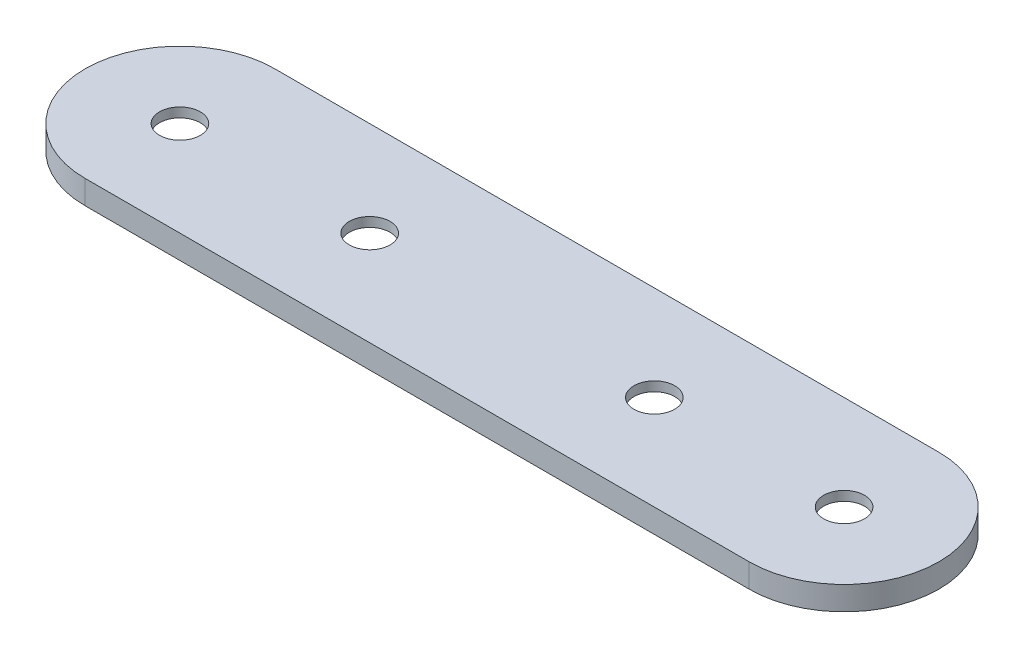
ISO-10303-21;
HEADER;
FILE_DESCRIPTION(('STEP AP214'),'2;1');
FILE_NAME('part.step','',(''),(''),'','','');
FILE_SCHEMA(('AUTOMOTIVE_DESIGN { 1 0 10303 214 1 1 1 1 }'));
ENDSEC;
DATA;
#1=APPLICATION_CONTEXT('core data for automotive mechanical design processes');
#2=APPLICATION_PROTOCOL_DEFINITION('international standard','automotive_design',2000,#1);
#3=PRODUCT_CONTEXT('',#1,'mechanical');
#4=PRODUCT('Part','Part','',(#3));
#5=PRODUCT_RELATED_PRODUCT_CATEGORY('part','',(#4));
#6=PRODUCT_DEFINITION_FORMATION('','',#4);
#7=PRODUCT_DEFINITION_CONTEXT('part definition',#1,'design');
#8=PRODUCT_DEFINITION('design','',#6,#7);
#9=PRODUCT_DEFINITION_SHAPE('','',#8);
#10=(LENGTH_UNIT() NAMED_UNIT(*) SI_UNIT(.MILLI.,.METRE.));
#11=(NAMED_UNIT(*) PLANE_ANGLE_UNIT() SI_UNIT($,.RADIAN.));
#12=(NAMED_UNIT(*) SI_UNIT($,.STERADIAN.) SOLID_ANGLE_UNIT());
#13=UNCERTAINTY_MEASURE_WITH_UNIT(LENGTH_MEASURE(1.E-05),#10,'distance_accuracy_value','');
#14=(GEOMETRIC_REPRESENTATION_CONTEXT(3) GLOBAL_UNCERTAINTY_ASSIGNED_CONTEXT((#13)) GLOBAL_UNIT_ASSIGNED_CONTEXT((#10,
#11,#12)) REPRESENTATION_CONTEXT('',''));
#15=CARTESIAN_POINT('',(0.,0.,0.));
#16=DIRECTION('',(0.,0.,1.));
#17=DIRECTION('',(1.,0.,0.));
#18=AXIS2_PLACEMENT_3D('',#15,#16,#17);
#19=CARTESIAN_POINT('',(0.,-2.5,0.));
#20=DIRECTION('',(0.,1.,0.));
#21=DIRECTION('',(0.,0.,1.));
#22=AXIS2_PLACEMENT_3D('',#19,#20,#21);
#23=CYLINDRICAL_SURFACE('',#22,10.);
#24=CARTESIAN_POINT('',(0.,0.,0.));
#25=DIRECTION('',(0.,1.,0.));
#26=DIRECTION('',(0.,0.,1.));
#27=AXIS2_PLACEMENT_3D('',#24,#25,#26);
#28=CIRCLE('',#27,10.);
#29=CARTESIAN_POINT('',(0.,0.,10.));
#30=VERTEX_POINT('',#29);
#31=CARTESIAN_POINT('',(0.,0.,-10.));
#32=VERTEX_POINT('',#31);
#33=EDGE_CURVE('E207',#30,#32,#28,.T.);
#34=ORIENTED_EDGE('',*,*,#33,.F.);
#35=DIRECTION('',(0.,1.,0.));
#36=VECTOR('',#35,1.);
#37=CARTESIAN_POINT('',(0.,-2.5,10.));
#38=LINE('',#37,#36);
#39=CARTESIAN_POINT('',(0.,-2.5,10.));
#40=VERTEX_POINT('',#39);
#41=EDGE_CURVE('E117',#40,#30,#38,.T.);
#42=ORIENTED_EDGE('',*,*,#41,.F.);
#43=CARTESIAN_POINT('',(0.,-2.5,0.));
#44=DIRECTION('',(0.,1.,0.));
#45=DIRECTION('',(0.,0.,1.));
#46=AXIS2_PLACEMENT_3D('',#43,#44,#45);
#47=CIRCLE('',#46,10.);
#48=CARTESIAN_POINT('',(0.,-2.5,-10.));
#49=VERTEX_POINT('',#48);
#50=EDGE_CURVE('E109',#40,#49,#47,.T.);
#51=ORIENTED_EDGE('',*,*,#50,.T.);
#52=DIRECTION('',(0.,1.,0.));
#53=VECTOR('',#52,1.);
#54=CARTESIAN_POINT('',(0.,-2.5,-10.));
#55=LINE('',#54,#53);
#56=EDGE_CURVE('E106',#49,#32,#55,.T.);
#57=ORIENTED_EDGE('',*,*,#56,.T.);
#58=EDGE_LOOP('',(#34,#42,#51,#57));
#59=FACE_BOUND('',#58,.T.);
#60=ADVANCED_FACE('F53',(#59),#23,.T.);
#61=CARTESIAN_POINT('',(0.,-2.5,10.));
#62=DIRECTION('',(0.,0.,1.));
#63=DIRECTION('',(1.,0.,0.));
#64=AXIS2_PLACEMENT_3D('',#61,#62,#63);
#65=PLANE('',#64);
#66=DIRECTION('',(1.,0.,0.));
#67=VECTOR('',#66,1.);
#68=CARTESIAN_POINT('',(0.,0.,10.));
#69=LINE('',#68,#67);
#70=CARTESIAN_POINT('',(-70.,0.,10.));
#71=VERTEX_POINT('',#70);
#72=EDGE_CURVE('E92',#71,#30,#69,.T.);
#73=ORIENTED_EDGE('',*,*,#72,.F.);
#74=DIRECTION('',(0.,1.,0.));
#75=VECTOR('',#74,1.);
#76=CARTESIAN_POINT('',(-70.,-2.5,10.));
#77=LINE('',#76,#75);
#78=CARTESIAN_POINT('',(-70.,-2.5,10.));
#79=VERTEX_POINT('',#78);
#80=EDGE_CURVE('E115',#79,#71,#77,.T.);
#81=ORIENTED_EDGE('',*,*,#80,.F.);
#82=DIRECTION('',(1.,0.,0.));
#83=VECTOR('',#82,1.);
#84=CARTESIAN_POINT('',(0.,-2.5,10.));
#85=LINE('',#84,#83);
#86=EDGE_CURVE('E70',#79,#40,#85,.T.);
#87=ORIENTED_EDGE('',*,*,#86,.T.);
#88=ORIENTED_EDGE('',*,*,#41,.T.);
#89=EDGE_LOOP('',(#73,#81,#87,#88));
#90=FACE_BOUND('',#89,.T.);
#91=ADVANCED_FACE('F164',(#90),#65,.T.);
#92=CARTESIAN_POINT('',(-70.,-2.5,0.));
#93=DIRECTION('',(0.,1.,0.));
#94=DIRECTION('',(0.,0.,1.));
#95=AXIS2_PLACEMENT_3D('',#92,#93,#94);
#96=CYLINDRICAL_SURFACE('',#95,10.);
#97=CARTESIAN_POINT('',(-70.,0.,0.));
#98=DIRECTION('',(0.,1.,0.));
#99=DIRECTION('',(0.,0.,1.));
#100=AXIS2_PLACEMENT_3D('',#97,#98,#99);
#101=CIRCLE('',#100,10.);
#102=CARTESIAN_POINT('',(-70.,0.,-9.99999999999999));
#103=VERTEX_POINT('',#102);
#104=EDGE_CURVE('E87',#103,#71,#101,.T.);
#105=ORIENTED_EDGE('',*,*,#104,.F.);
#106=DIRECTION('',(0.,1.,0.));
#107=VECTOR('',#106,1.);
#108=CARTESIAN_POINT('',(-70.,-2.5,-9.99999999999999));
#109=LINE('',#108,#107);
#110=CARTESIAN_POINT('',(-70.,-2.5,-9.99999999999999));
#111=VERTEX_POINT('',#110);
#112=EDGE_CURVE('E104',#111,#103,#109,.T.);
#113=ORIENTED_EDGE('',*,*,#112,.F.);
#114=CARTESIAN_POINT('',(-70.,-2.5,0.));
#115=DIRECTION('',(0.,1.,0.));
#116=DIRECTION('',(0.,0.,1.));
#117=AXIS2_PLACEMENT_3D('',#114,#115,#116);
#118=CIRCLE('',#117,10.);
#119=EDGE_CURVE('E108',#111,#79,#118,.T.);
#120=ORIENTED_EDGE('',*,*,#119,.T.);
#121=ORIENTED_EDGE('',*,*,#80,.T.);
#122=EDGE_LOOP('',(#105,#113,#120,#121));
#123=FACE_BOUND('',#122,.T.);
#124=ADVANCED_FACE('F114',(#123),#96,.T.);
#125=CARTESIAN_POINT('',(0.,-2.5,-10.));
#126=DIRECTION('',(0.,0.,-1.));
#127=DIRECTION('',(-1.,0.,0.));
#128=AXIS2_PLACEMENT_3D('',#125,#126,#127);
#129=PLANE('',#128);
#130=DIRECTION('',(-1.,0.,0.));
#131=VECTOR('',#130,1.);
#132=CARTESIAN_POINT('',(0.,0.,-10.));
#133=LINE('',#132,#131);
#134=EDGE_CURVE('E211',#32,#103,#133,.T.);
#135=ORIENTED_EDGE('',*,*,#134,.F.);
#136=ORIENTED_EDGE('',*,*,#56,.F.);
#137=DIRECTION('',(-1.,0.,0.));
#138=VECTOR('',#137,1.);
#139=CARTESIAN_POINT('',(0.,-2.5,-10.));
#140=LINE('',#139,#138);
#141=EDGE_CURVE('E98',#49,#111,#140,.T.);
#142=ORIENTED_EDGE('',*,*,#141,.T.);
#143=ORIENTED_EDGE('',*,*,#112,.T.);
#144=EDGE_LOOP('',(#135,#136,#142,#143));
#145=FACE_BOUND('',#144,.T.);
#146=ADVANCED_FACE('F102',(#145),#129,.T.);
#147=CARTESIAN_POINT('',(0.,-2.5,0.));
#148=DIRECTION('',(0.,1.,0.));
#149=DIRECTION('',(0.,0.,1.));
#150=AXIS2_PLACEMENT_3D('',#147,#148,#149);
#151=PLANE('',#150);
#152=CARTESIAN_POINT('',(-70.,-2.5,0.));
#153=DIRECTION('',(0.,1.,0.));
#154=DIRECTION('',(0.,0.,1.));
#155=AXIS2_PLACEMENT_3D('',#152,#153,#154);
#156=CIRCLE('',#155,4.74807621135334);
#157=CARTESIAN_POINT('',(-70.,-2.5,4.74807621135335));
#158=VERTEX_POINT('',#157);
#159=EDGE_CURVE('E131',#158,#158,#156,.T.);
#160=ORIENTED_EDGE('',*,*,#159,.T.);
#161=EDGE_LOOP('',(#160));
#162=FACE_BOUND('',#161,.T.);
#163=CARTESIAN_POINT('',(-50.,-2.5,0.));
#164=DIRECTION('',(0.,1.,0.));
#165=DIRECTION('',(0.,0.,1.));
#166=AXIS2_PLACEMENT_3D('',#163,#164,#165);
#167=CIRCLE('',#166,4.74807621135333);
#168=CARTESIAN_POINT('',(-50.,-2.5,4.74807621135333));
#169=VERTEX_POINT('',#168);
#170=EDGE_CURVE('E128',#169,#169,#167,.T.);
#171=ORIENTED_EDGE('',*,*,#170,.T.);
#172=EDGE_LOOP('',(#171));
#173=FACE_BOUND('',#172,.T.);
#174=CARTESIAN_POINT('',(-20.,-2.5,0.));
#175=DIRECTION('',(0.,1.,0.));
#176=DIRECTION('',(0.,0.,1.));
#177=AXIS2_PLACEMENT_3D('',#174,#175,#176);
#178=CIRCLE('',#177,4.74807621135333);
#179=CARTESIAN_POINT('',(-20.,-2.5,4.74807621135333));
#180=VERTEX_POINT('',#179);
#181=EDGE_CURVE('E125',#180,#180,#178,.T.);
#182=ORIENTED_EDGE('',*,*,#181,.T.);
#183=EDGE_LOOP('',(#182));
#184=FACE_BOUND('',#183,.T.);
#185=CARTESIAN_POINT('',(0.,-2.5,0.));
#186=DIRECTION('',(0.,1.,0.));
#187=DIRECTION('',(0.,0.,1.));
#188=AXIS2_PLACEMENT_3D('',#185,#186,#187);
#189=CIRCLE('',#188,4.74807621135331);
#190=CARTESIAN_POINT('',(0.,-2.5,4.74807621135331));
#191=VERTEX_POINT('',#190);
#192=EDGE_CURVE('E122',#191,#191,#189,.T.);
#193=ORIENTED_EDGE('',*,*,#192,.T.);
#194=EDGE_LOOP('',(#193));
#195=FACE_BOUND('',#194,.T.);
#196=ORIENTED_EDGE('',*,*,#50,.F.);
#197=ORIENTED_EDGE('',*,*,#86,.F.);
#198=ORIENTED_EDGE('',*,*,#119,.F.);
#199=ORIENTED_EDGE('',*,*,#141,.F.);
#200=EDGE_LOOP('',(#196,#197,#198,#199));
#201=FACE_BOUND('',#200,.T.);
#202=ADVANCED_FACE('F111',(#162,#173,#184,#195,#201),#151,.F.);
#203=CARTESIAN_POINT('',(0.,0.,0.));
#204=DIRECTION('',(0.,1.,0.));
#205=DIRECTION('',(0.,0.,1.));
#206=AXIS2_PLACEMENT_3D('',#203,#204,#205);
#207=PLANE('',#206);
#208=CARTESIAN_POINT('',(-50.,0.,0.));
#209=DIRECTION('',(0.,1.,0.));
#210=DIRECTION('',(0.,0.,1.));
#211=AXIS2_PLACEMENT_3D('',#208,#209,#210);
#212=CIRCLE('',#211,2.15);
#213=CARTESIAN_POINT('',(-50.,0.,2.15000000000001));
#214=VERTEX_POINT('',#213);
#215=EDGE_CURVE('E194',#214,#214,#212,.T.);
#216=ORIENTED_EDGE('',*,*,#215,.F.);
#217=EDGE_LOOP('',(#216));
#218=FACE_BOUND('',#217,.T.);
#219=CARTESIAN_POINT('',(-20.,0.,0.));
#220=DIRECTION('',(0.,1.,0.));
#221=DIRECTION('',(0.,0.,1.));
#222=AXIS2_PLACEMENT_3D('',#219,#220,#221);
#223=CIRCLE('',#222,2.15);
#224=CARTESIAN_POINT('',(-20.,0.,2.15));
#225=VERTEX_POINT('',#224);
#226=EDGE_CURVE('E196',#225,#225,#223,.T.);
#227=ORIENTED_EDGE('',*,*,#226,.F.);
#228=EDGE_LOOP('',(#227));
#229=FACE_BOUND('',#228,.T.);
#230=CARTESIAN_POINT('',(-70.,0.,0.));
#231=DIRECTION('',(0.,1.,0.));
#232=DIRECTION('',(0.,0.,1.));
#233=AXIS2_PLACEMENT_3D('',#230,#231,#232);
#234=CIRCLE('',#233,2.15);
#235=CARTESIAN_POINT('',(-70.,0.,2.15000000000001));
#236=VERTEX_POINT('',#235);
#237=EDGE_CURVE('E199',#236,#236,#234,.T.);
#238=ORIENTED_EDGE('',*,*,#237,.F.);
#239=EDGE_LOOP('',(#238));
#240=FACE_BOUND('',#239,.T.);
#241=CARTESIAN_POINT('',(0.,0.,0.));
#242=DIRECTION('',(0.,1.,0.));
#243=DIRECTION('',(0.,0.,1.));
#244=AXIS2_PLACEMENT_3D('',#241,#242,#243);
#245=CIRCLE('',#244,2.15);
#246=CARTESIAN_POINT('',(0.,0.,2.15));
#247=VERTEX_POINT('',#246);
#248=EDGE_CURVE('E204',#247,#247,#245,.T.);
#249=ORIENTED_EDGE('',*,*,#248,.F.);
#250=EDGE_LOOP('',(#249));
#251=FACE_BOUND('',#250,.T.);
#252=ORIENTED_EDGE('',*,*,#33,.T.);
#253=ORIENTED_EDGE('',*,*,#134,.T.);
#254=ORIENTED_EDGE('',*,*,#104,.T.);
#255=ORIENTED_EDGE('',*,*,#72,.T.);
#256=EDGE_LOOP('',(#252,#253,#254,#255));
#257=FACE_BOUND('',#256,.T.);
#258=ADVANCED_FACE('F153',(#218,#229,#240,#251,#257),#207,.T.);
#259=CARTESIAN_POINT('',(0.,-2.5,0.));
#260=DIRECTION('',(0.,1.,0.));
#261=DIRECTION('',(0.,0.,1.));
#262=AXIS2_PLACEMENT_3D('',#259,#260,#261);
#263=CYLINDRICAL_SURFACE('',#262,2.15);
#264=CARTESIAN_POINT('',(0.,-0.999999999999997,0.));
#265=DIRECTION('',(0.,1.,0.));
#266=DIRECTION('',(0.,0.,1.));
#267=AXIS2_PLACEMENT_3D('',#264,#265,#266);
#268=CIRCLE('',#267,2.15);
#269=CARTESIAN_POINT('',(0.,-0.999999999999997,2.15));
#270=VERTEX_POINT('',#269);
#271=EDGE_CURVE('E13',#270,#270,#268,.F.);
#272=ORIENTED_EDGE('',*,*,#271,.T.);
#273=EDGE_LOOP('',(#272));
#274=FACE_BOUND('',#273,.T.);
#275=ORIENTED_EDGE('',*,*,#248,.T.);
#276=EDGE_LOOP('',(#275));
#277=FACE_BOUND('',#276,.T.);
#278=ADVANCED_FACE('F216',(#274,#277),#263,.F.);
#279=CARTESIAN_POINT('',(-70.,-2.5,0.));
#280=DIRECTION('',(0.,1.,0.));
#281=DIRECTION('',(0.,0.,1.));
#282=AXIS2_PLACEMENT_3D('',#279,#280,#281);
#283=CYLINDRICAL_SURFACE('',#282,2.15);
#284=CARTESIAN_POINT('',(-70.,-0.999999999999983,0.));
#285=DIRECTION('',(0.,1.,0.));
#286=DIRECTION('',(0.,0.,1.));
#287=AXIS2_PLACEMENT_3D('',#284,#285,#286);
#288=CIRCLE('',#287,2.15);
#289=CARTESIAN_POINT('',(-70.,-0.999999999999983,2.15000000000001));
#290=VERTEX_POINT('',#289);
#291=EDGE_CURVE('E134',#290,#290,#288,.F.);
#292=ORIENTED_EDGE('',*,*,#291,.T.);
#293=EDGE_LOOP('',(#292));
#294=FACE_BOUND('',#293,.T.);
#295=ORIENTED_EDGE('',*,*,#237,.T.);
#296=EDGE_LOOP('',(#295));
#297=FACE_BOUND('',#296,.T.);
#298=ADVANCED_FACE('F221',(#294,#297),#283,.F.);
#299=CARTESIAN_POINT('',(-20.,-2.5,0.));
#300=DIRECTION('',(0.,1.,0.));
#301=DIRECTION('',(0.,0.,1.));
#302=AXIS2_PLACEMENT_3D('',#299,#300,#301);
#303=CYLINDRICAL_SURFACE('',#302,2.15);
#304=CARTESIAN_POINT('',(-20.,-0.999999999999988,0.));
#305=DIRECTION('',(0.,1.,0.));
#306=DIRECTION('',(0.,0.,1.));
#307=AXIS2_PLACEMENT_3D('',#304,#305,#306);
#308=CIRCLE('',#307,2.15);
#309=CARTESIAN_POINT('',(-20.,-0.999999999999988,2.15));
#310=VERTEX_POINT('',#309);
#311=EDGE_CURVE('E62',#310,#310,#308,.F.);
#312=ORIENTED_EDGE('',*,*,#311,.T.);
#313=EDGE_LOOP('',(#312));
#314=FACE_BOUND('',#313,.T.);
#315=ORIENTED_EDGE('',*,*,#226,.T.);
#316=EDGE_LOOP('',(#315));
#317=FACE_BOUND('',#316,.T.);
#318=ADVANCED_FACE('F142',(#314,#317),#303,.F.);
#319=CARTESIAN_POINT('',(-50.,-2.5,0.));
#320=DIRECTION('',(0.,1.,0.));
#321=DIRECTION('',(0.,0.,1.));
#322=AXIS2_PLACEMENT_3D('',#319,#320,#321);
#323=CYLINDRICAL_SURFACE('',#322,2.15);
#324=CARTESIAN_POINT('',(-50.,-0.99999999999999,0.));
#325=DIRECTION('',(0.,1.,0.));
#326=DIRECTION('',(0.,0.,1.));
#327=AXIS2_PLACEMENT_3D('',#324,#325,#326);
#328=CIRCLE('',#327,2.15);
#329=CARTESIAN_POINT('',(-50.,-0.99999999999999,2.15000000000001));
#330=VERTEX_POINT('',#329);
#331=EDGE_CURVE('E137',#330,#330,#328,.F.);
#332=ORIENTED_EDGE('',*,*,#331,.T.);
#333=EDGE_LOOP('',(#332));
#334=FACE_BOUND('',#333,.T.);
#335=ORIENTED_EDGE('',*,*,#215,.T.);
#336=EDGE_LOOP('',(#335));
#337=FACE_BOUND('',#336,.T.);
#338=ADVANCED_FACE('F178',(#334,#337),#323,.F.);
#339=CARTESIAN_POINT('',(-70.,-2.5,0.));
#340=DIRECTION('',(0.,-1.,0.));
#341=DIRECTION('',(0.,0.,-1.));
#342=AXIS2_PLACEMENT_3D('',#339,#340,#341);
#343=CONICAL_SURFACE('',#342,4.74807621135334,1.0471975511966);
#344=ORIENTED_EDGE('',*,*,#291,.F.);
#345=EDGE_LOOP('',(#344));
#346=FACE_BOUND('',#345,.T.);
#347=ORIENTED_EDGE('',*,*,#159,.F.);
#348=EDGE_LOOP('',(#347));
#349=FACE_BOUND('',#348,.T.);
#350=ADVANCED_FACE('F175',(#346,#349),#343,.F.);
#351=CARTESIAN_POINT('',(-50.,-2.5,0.));
#352=DIRECTION('',(0.,-1.,0.));
#353=DIRECTION('',(0.,0.,-1.));
#354=AXIS2_PLACEMENT_3D('',#351,#352,#353);
#355=CONICAL_SURFACE('',#354,4.74807621135333,1.0471975511966);
#356=ORIENTED_EDGE('',*,*,#331,.F.);
#357=EDGE_LOOP('',(#356));
#358=FACE_BOUND('',#357,.T.);
#359=ORIENTED_EDGE('',*,*,#170,.F.);
#360=EDGE_LOOP('',(#359));
#361=FACE_BOUND('',#360,.T.);
#362=ADVANCED_FACE('F148',(#358,#361),#355,.F.);
#363=CARTESIAN_POINT('',(-20.,-2.5,0.));
#364=DIRECTION('',(0.,-1.,0.));
#365=DIRECTION('',(0.,0.,-1.));
#366=AXIS2_PLACEMENT_3D('',#363,#364,#365);
#367=CONICAL_SURFACE('',#366,4.74807621135333,1.0471975511966);
#368=ORIENTED_EDGE('',*,*,#311,.F.);
#369=EDGE_LOOP('',(#368));
#370=FACE_BOUND('',#369,.T.);
#371=ORIENTED_EDGE('',*,*,#181,.F.);
#372=EDGE_LOOP('',(#371));
#373=FACE_BOUND('',#372,.T.);
#374=ADVANCED_FACE('F145',(#370,#373),#367,.F.);
#375=CARTESIAN_POINT('',(0.,-2.5,0.));
#376=DIRECTION('',(0.,-1.,0.));
#377=DIRECTION('',(0.,0.,-1.));
#378=AXIS2_PLACEMENT_3D('',#375,#376,#377);
#379=CONICAL_SURFACE('',#378,4.74807621135331,1.0471975511966);
#380=ORIENTED_EDGE('',*,*,#271,.F.);
#381=EDGE_LOOP('',(#380));
#382=FACE_BOUND('',#381,.T.);
#383=ORIENTED_EDGE('',*,*,#192,.F.);
#384=EDGE_LOOP('',(#383));
#385=FACE_BOUND('',#384,.T.);
#386=ADVANCED_FACE('F55',(#382,#385),#379,.F.);
#387=CLOSED_SHELL('',(#60,#91,#124,#146,#202,#258,#278,#298,#318,#338,#350,#362,#374,#386));
#388=MANIFOLD_SOLID_BREP('B2',#387);
#389=ADVANCED_BREP_SHAPE_REPRESENTATION('',(#18,#388),#14);
#390=SHAPE_DEFINITION_REPRESENTATION(#9,#389);
ENDSEC;
END-ISO-10303-21;
